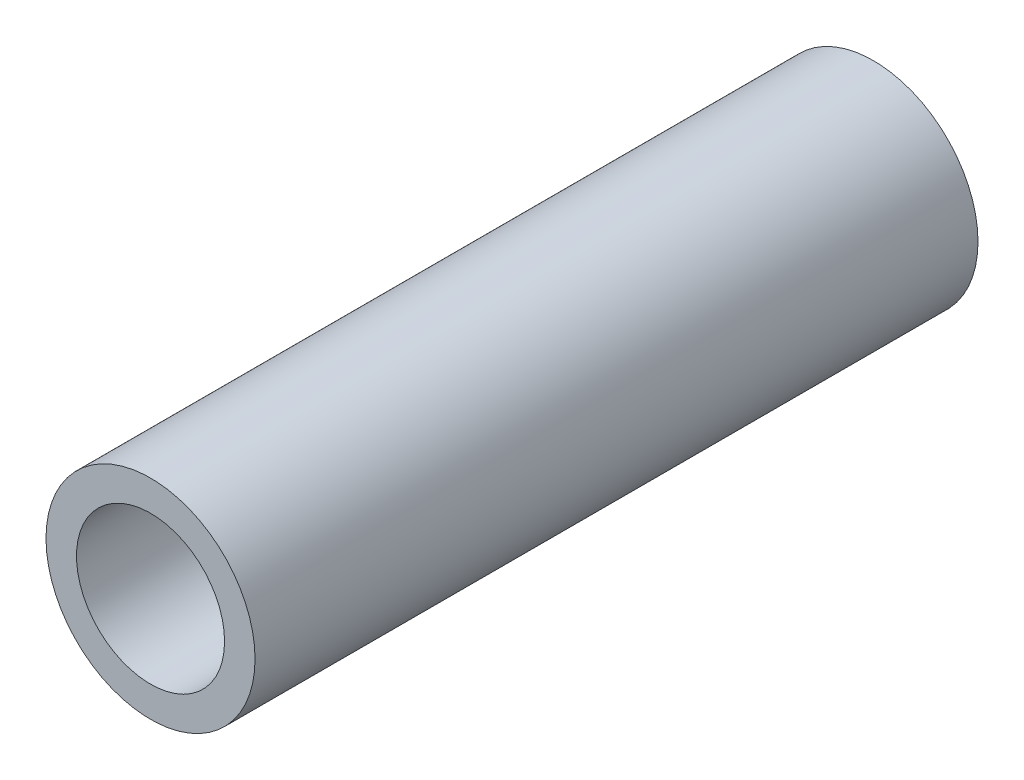
ISO-10303-21;
HEADER;
FILE_DESCRIPTION(('STEP AP214'),'2;1');
FILE_NAME('part.step','',(''),(''),'','','');
FILE_SCHEMA(('AUTOMOTIVE_DESIGN { 1 0 10303 214 1 1 1 1 }'));
ENDSEC;
DATA;
#1=APPLICATION_CONTEXT('core data for automotive mechanical design processes');
#2=APPLICATION_PROTOCOL_DEFINITION('international standard','automotive_design',2000,#1);
#3=PRODUCT_CONTEXT('',#1,'mechanical');
#4=PRODUCT('Part','Part','',(#3));
#5=PRODUCT_RELATED_PRODUCT_CATEGORY('part','',(#4));
#6=PRODUCT_DEFINITION_FORMATION('','',#4);
#7=PRODUCT_DEFINITION_CONTEXT('part definition',#1,'design');
#8=PRODUCT_DEFINITION('design','',#6,#7);
#9=PRODUCT_DEFINITION_SHAPE('','',#8);
#10=(LENGTH_UNIT() NAMED_UNIT(*) SI_UNIT(.MILLI.,.METRE.));
#11=(NAMED_UNIT(*) PLANE_ANGLE_UNIT() SI_UNIT($,.RADIAN.));
#12=(NAMED_UNIT(*) SI_UNIT($,.STERADIAN.) SOLID_ANGLE_UNIT());
#13=UNCERTAINTY_MEASURE_WITH_UNIT(LENGTH_MEASURE(1.E-05),#10,'distance_accuracy_value','');
#14=(GEOMETRIC_REPRESENTATION_CONTEXT(3) GLOBAL_UNCERTAINTY_ASSIGNED_CONTEXT((#13)) GLOBAL_UNIT_ASSIGNED_CONTEXT((#10,
#11,#12)) REPRESENTATION_CONTEXT('',''));
#15=CARTESIAN_POINT('',(0.,0.,0.));
#16=DIRECTION('',(0.,0.,1.));
#17=DIRECTION('',(1.,0.,0.));
#18=AXIS2_PLACEMENT_3D('',#15,#16,#17);
#19=CARTESIAN_POINT('',(0.,0.,41.5));
#20=DIRECTION('',(0.,0.,1.));
#21=DIRECTION('',(1.,0.,0.));
#22=AXIS2_PLACEMENT_3D('',#19,#20,#21);
#23=PLANE('',#22);
#24=CARTESIAN_POINT('',(0.,0.,41.5));
#25=DIRECTION('',(0.,0.,1.));
#26=DIRECTION('',(1.,0.,0.));
#27=AXIS2_PLACEMENT_3D('',#24,#25,#26);
#28=CIRCLE('',#27,12.);
#29=CARTESIAN_POINT('',(12.,0.,41.5));
#30=VERTEX_POINT('',#29);
#31=EDGE_CURVE('E10',#30,#30,#28,.T.);
#32=ORIENTED_EDGE('',*,*,#31,.T.);
#33=EDGE_LOOP('',(#32));
#34=FACE_BOUND('',#33,.T.);
#35=CARTESIAN_POINT('',(0.,0.,41.5));
#36=DIRECTION('',(0.,0.,1.));
#37=DIRECTION('',(1.,0.,0.));
#38=AXIS2_PLACEMENT_3D('',#35,#36,#37);
#39=CIRCLE('',#38,8.5);
#40=CARTESIAN_POINT('',(8.5,0.,41.5));
#41=VERTEX_POINT('',#40);
#42=EDGE_CURVE('E43',#41,#41,#39,.T.);
#43=ORIENTED_EDGE('',*,*,#42,.F.);
#44=EDGE_LOOP('',(#43));
#45=FACE_BOUND('',#44,.T.);
#46=ADVANCED_FACE('F32',(#34,#45),#23,.T.);
#47=CARTESIAN_POINT('',(0.,0.,-41.5));
#48=DIRECTION('',(0.,0.,1.));
#49=DIRECTION('',(1.,0.,0.));
#50=AXIS2_PLACEMENT_3D('',#47,#48,#49);
#51=PLANE('',#50);
#52=CARTESIAN_POINT('',(0.,0.,-41.5));
#53=DIRECTION('',(0.,0.,1.));
#54=DIRECTION('',(1.,0.,0.));
#55=AXIS2_PLACEMENT_3D('',#52,#53,#54);
#56=CIRCLE('',#55,12.);
#57=CARTESIAN_POINT('',(12.,0.,-41.5));
#58=VERTEX_POINT('',#57);
#59=EDGE_CURVE('E36',#58,#58,#56,.T.);
#60=ORIENTED_EDGE('',*,*,#59,.F.);
#61=EDGE_LOOP('',(#60));
#62=FACE_BOUND('',#61,.T.);
#63=CARTESIAN_POINT('',(0.,0.,-41.5));
#64=DIRECTION('',(0.,0.,1.));
#65=DIRECTION('',(1.,0.,0.));
#66=AXIS2_PLACEMENT_3D('',#63,#64,#65);
#67=CIRCLE('',#66,8.5);
#68=CARTESIAN_POINT('',(8.5,0.,-41.5));
#69=VERTEX_POINT('',#68);
#70=EDGE_CURVE('E45',#69,#69,#67,.T.);
#71=ORIENTED_EDGE('',*,*,#70,.T.);
#72=EDGE_LOOP('',(#71));
#73=FACE_BOUND('',#72,.T.);
#74=ADVANCED_FACE('F55',(#62,#73),#51,.F.);
#75=CARTESIAN_POINT('',(0.,0.,41.5));
#76=DIRECTION('',(0.,0.,-1.));
#77=DIRECTION('',(-1.,0.,0.));
#78=AXIS2_PLACEMENT_3D('',#75,#76,#77);
#79=CYLINDRICAL_SURFACE('',#78,12.);
#80=ORIENTED_EDGE('',*,*,#31,.F.);
#81=EDGE_LOOP('',(#80));
#82=FACE_BOUND('',#81,.T.);
#83=ORIENTED_EDGE('',*,*,#59,.T.);
#84=EDGE_LOOP('',(#83));
#85=FACE_BOUND('',#84,.T.);
#86=ADVANCED_FACE('F34',(#82,#85),#79,.T.);
#87=CARTESIAN_POINT('',(0.,0.,41.5));
#88=DIRECTION('',(0.,0.,-1.));
#89=DIRECTION('',(-1.,0.,0.));
#90=AXIS2_PLACEMENT_3D('',#87,#88,#89);
#91=CYLINDRICAL_SURFACE('',#90,8.5);
#92=ORIENTED_EDGE('',*,*,#42,.T.);
#93=EDGE_LOOP('',(#92));
#94=FACE_BOUND('',#93,.T.);
#95=ORIENTED_EDGE('',*,*,#70,.F.);
#96=EDGE_LOOP('',(#95));
#97=FACE_BOUND('',#96,.T.);
#98=ADVANCED_FACE('F51',(#94,#97),#91,.F.);
#99=CLOSED_SHELL('',(#46,#74,#86,#98));
#100=MANIFOLD_SOLID_BREP('B2',#99);
#101=ADVANCED_BREP_SHAPE_REPRESENTATION('',(#18,#100),#14);
#102=SHAPE_DEFINITION_REPRESENTATION(#9,#101);
ENDSEC;
END-ISO-10303-21;
